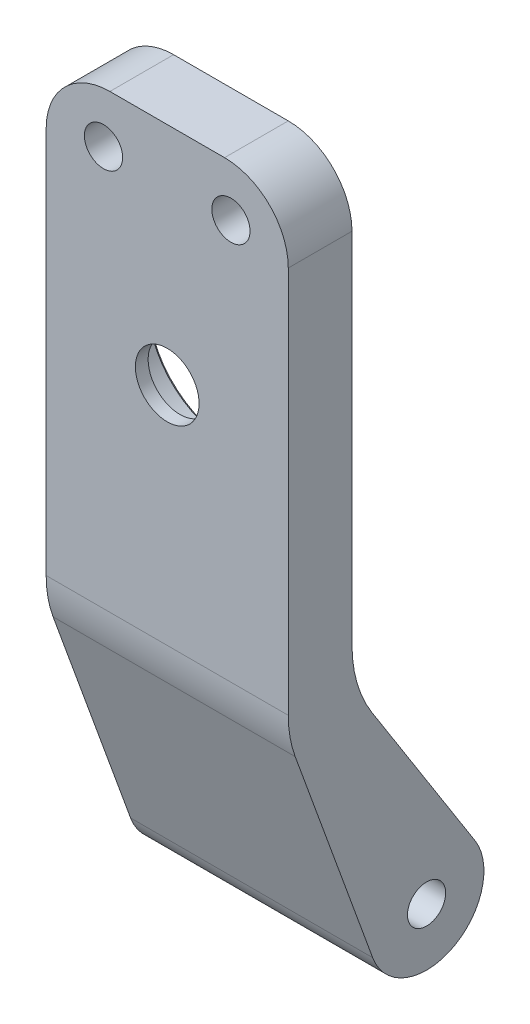
ISO-10303-21;
HEADER;
FILE_DESCRIPTION(('STEP AP214'),'2;1');
FILE_NAME('part.step','',(''),(''),'','','');
FILE_SCHEMA(('AUTOMOTIVE_DESIGN { 1 0 10303 214 1 1 1 1 }'));
ENDSEC;
DATA;
#1=APPLICATION_CONTEXT('core data for automotive mechanical design processes');
#2=APPLICATION_PROTOCOL_DEFINITION('international standard','automotive_design',2000,#1);
#3=PRODUCT_CONTEXT('',#1,'mechanical');
#4=PRODUCT('Part','Part','',(#3));
#5=PRODUCT_RELATED_PRODUCT_CATEGORY('part','',(#4));
#6=PRODUCT_DEFINITION_FORMATION('','',#4);
#7=PRODUCT_DEFINITION_CONTEXT('part definition',#1,'design');
#8=PRODUCT_DEFINITION('design','',#6,#7);
#9=PRODUCT_DEFINITION_SHAPE('','',#8);
#10=(LENGTH_UNIT() NAMED_UNIT(*) SI_UNIT(.MILLI.,.METRE.));
#11=(NAMED_UNIT(*) PLANE_ANGLE_UNIT() SI_UNIT($,.RADIAN.));
#12=(NAMED_UNIT(*) SI_UNIT($,.STERADIAN.) SOLID_ANGLE_UNIT());
#13=UNCERTAINTY_MEASURE_WITH_UNIT(LENGTH_MEASURE(1.E-05),#10,'distance_accuracy_value','');
#14=(GEOMETRIC_REPRESENTATION_CONTEXT(3) GLOBAL_UNCERTAINTY_ASSIGNED_CONTEXT((#13)) GLOBAL_UNIT_ASSIGNED_CONTEXT((#10,
#11,#12)) REPRESENTATION_CONTEXT('',''));
#15=CARTESIAN_POINT('',(0.,0.,0.));
#16=DIRECTION('',(0.,0.,1.));
#17=DIRECTION('',(1.,0.,0.));
#18=AXIS2_PLACEMENT_3D('',#15,#16,#17);
#19=CARTESIAN_POINT('',(0.,13.1015537091819,20.7143094769658));
#20=DIRECTION('',(0.,0.,-1.));
#21=DIRECTION('',(-1.,0.,0.));
#22=AXIS2_PLACEMENT_3D('',#19,#20,#21);
#23=CONICAL_SURFACE('',#22,6.,0.785398163397448);
#24=CARTESIAN_POINT('',(0.,13.1015537091819,20.2143094769658));
#25=DIRECTION('',(0.,0.,1.));
#26=DIRECTION('',(-1.,0.,0.));
#27=AXIS2_PLACEMENT_3D('',#24,#25,#26);
#28=CIRCLE('',#27,6.5);
#29=CARTESIAN_POINT('',(-6.5,13.1015537091819,20.2143094769658));
#30=VERTEX_POINT('',#29);
#31=EDGE_CURVE('E145',#30,#30,#28,.T.);
#32=ORIENTED_EDGE('',*,*,#31,.F.);
#33=EDGE_LOOP('',(#32));
#34=FACE_BOUND('',#33,.T.);
#35=CARTESIAN_POINT('',(0.,13.1015537091819,20.4643094769658));
#36=DIRECTION('',(0.,0.,-1.));
#37=DIRECTION('',(-1.,0.,0.));
#38=AXIS2_PLACEMENT_3D('',#35,#36,#37);
#39=CIRCLE('',#38,6.25);
#40=CARTESIAN_POINT('',(-6.25,13.1015537091819,20.4643094769658));
#41=VERTEX_POINT('',#40);
#42=EDGE_CURVE('E173',#41,#41,#39,.T.);
#43=ORIENTED_EDGE('',*,*,#42,.F.);
#44=EDGE_LOOP('',(#43));
#45=FACE_BOUND('',#44,.T.);
#46=ADVANCED_FACE('F43',(#34,#45),#23,.F.);
#47=CARTESIAN_POINT('',(9.5,7.60659887027264,25.2143094769657));
#48=DIRECTION('',(0.,0.,-1.));
#49=DIRECTION('',(-1.,0.,0.));
#50=AXIS2_PLACEMENT_3D('',#47,#48,#49);
#51=PLANE('',#50);
#52=CARTESIAN_POINT('',(-5.,26.8080822959938,25.2143094769657));
#53=DIRECTION('',(0.,0.,1.));
#54=DIRECTION('',(1.,0.,0.));
#55=AXIS2_PLACEMENT_3D('',#52,#53,#54);
#56=CIRCLE('',#55,1.5);
#57=CARTESIAN_POINT('',(-3.5,26.8080822959938,25.2143094769657));
#58=VERTEX_POINT('',#57);
#59=EDGE_CURVE('E179',#58,#58,#56,.T.);
#60=ORIENTED_EDGE('',*,*,#59,.F.);
#61=EDGE_LOOP('',(#60));
#62=FACE_BOUND('',#61,.T.);
#63=CARTESIAN_POINT('',(5.,26.8080822959938,25.2143094769657));
#64=DIRECTION('',(0.,0.,1.));
#65=DIRECTION('',(1.,0.,0.));
#66=AXIS2_PLACEMENT_3D('',#63,#64,#65);
#67=CIRCLE('',#66,1.5);
#68=CARTESIAN_POINT('',(6.5,26.8080822959938,25.2143094769657));
#69=VERTEX_POINT('',#68);
#70=EDGE_CURVE('E184',#69,#69,#67,.T.);
#71=ORIENTED_EDGE('',*,*,#70,.F.);
#72=EDGE_LOOP('',(#71));
#73=FACE_BOUND('',#72,.T.);
#74=CARTESIAN_POINT('',(0.,13.1015537091819,25.2143094769657));
#75=DIRECTION('',(0.,0.,-1.));
#76=DIRECTION('',(0.,1.,0.));
#77=AXIS2_PLACEMENT_3D('',#74,#75,#76);
#78=CIRCLE('',#77,2.5);
#79=CARTESIAN_POINT('',(0.,15.6015537091819,25.2143094769657));
#80=VERTEX_POINT('',#79);
#81=EDGE_CURVE('E11',#80,#80,#78,.T.);
#82=ORIENTED_EDGE('',*,*,#81,.T.);
#83=EDGE_LOOP('',(#82));
#84=FACE_BOUND('',#83,.T.);
#85=DIRECTION('',(-1.,0.,0.));
#86=VECTOR('',#85,1.);
#87=CARTESIAN_POINT('',(9.5,30.8080822959938,25.2143094769657));
#88=LINE('',#87,#86);
#89=CARTESIAN_POINT('',(4.5,30.8080822959938,25.2143094769657));
#90=VERTEX_POINT('',#89);
#91=CARTESIAN_POINT('',(-4.5,30.8080822959938,25.2143094769657));
#92=VERTEX_POINT('',#91);
#93=EDGE_CURVE('E53',#90,#92,#88,.T.);
#94=ORIENTED_EDGE('',*,*,#93,.T.);
#95=CARTESIAN_POINT('',(-4.5,25.8080822959938,25.2143094769657));
#96=DIRECTION('',(0.,0.,1.));
#97=DIRECTION('',(0.,1.,0.));
#98=AXIS2_PLACEMENT_3D('',#95,#96,#97);
#99=CIRCLE('',#98,5.);
#100=CARTESIAN_POINT('',(-9.5,25.8080822959938,25.2143094769657));
#101=VERTEX_POINT('',#100);
#102=EDGE_CURVE('E219',#92,#101,#99,.T.);
#103=ORIENTED_EDGE('',*,*,#102,.T.);
#104=DIRECTION('',(0.,-1.,0.));
#105=VECTOR('',#104,1.);
#106=CARTESIAN_POINT('',(-9.5,7.60659887027264,25.2143094769657));
#107=LINE('',#106,#105);
#108=CARTESIAN_POINT('',(-9.5,-4.59488455544854,25.2143094769657));
#109=VERTEX_POINT('',#108);
#110=EDGE_CURVE('E214',#101,#109,#107,.T.);
#111=ORIENTED_EDGE('',*,*,#110,.T.);
#112=DIRECTION('',(-1.,0.,0.));
#113=VECTOR('',#112,1.);
#114=CARTESIAN_POINT('',(9.5,-4.59488455544854,25.2143094769657));
#115=LINE('',#114,#113);
#116=CARTESIAN_POINT('',(9.5,-4.59488455544854,25.2143094769657));
#117=VERTEX_POINT('',#116);
#118=EDGE_CURVE('E201',#117,#109,#115,.T.);
#119=ORIENTED_EDGE('',*,*,#118,.F.);
#120=DIRECTION('',(0.,-1.,0.));
#121=VECTOR('',#120,1.);
#122=CARTESIAN_POINT('',(9.5,7.60659887027264,25.2143094769657));
#123=LINE('',#122,#121);
#124=CARTESIAN_POINT('',(9.5,25.8080822959938,25.2143094769657));
#125=VERTEX_POINT('',#124);
#126=EDGE_CURVE('E207',#125,#117,#123,.T.);
#127=ORIENTED_EDGE('',*,*,#126,.F.);
#128=CARTESIAN_POINT('',(4.5,25.8080822959938,25.2143094769657));
#129=DIRECTION('',(0.,0.,1.));
#130=DIRECTION('',(0.,1.,0.));
#131=AXIS2_PLACEMENT_3D('',#128,#129,#130);
#132=CIRCLE('',#131,5.);
#133=EDGE_CURVE('E206',#125,#90,#132,.T.);
#134=ORIENTED_EDGE('',*,*,#133,.T.);
#135=EDGE_LOOP('',(#94,#103,#111,#119,#127,#134));
#136=FACE_BOUND('',#135,.T.);
#137=ADVANCED_FACE('F45',(#62,#73,#84,#136),#51,.F.);
#138=CARTESIAN_POINT('',(9.5,-4.59488455544854,16.2143094769658));
#139=DIRECTION('',(-1.,0.,0.));
#140=DIRECTION('',(0.,0.,1.));
#141=AXIS2_PLACEMENT_3D('',#138,#139,#140);
#142=CYLINDRICAL_SURFACE('',#141,9.);
#143=CARTESIAN_POINT('',(-9.5,-4.59488455544854,16.2143094769658));
#144=DIRECTION('',(1.,0.,0.));
#145=DIRECTION('',(0.,0.,-1.));
#146=AXIS2_PLACEMENT_3D('',#143,#144,#145);
#147=CIRCLE('',#146,9.);
#148=CARTESIAN_POINT('',(-9.5,-7.67306584537955,24.671543064039));
#149=VERTEX_POINT('',#148);
#150=EDGE_CURVE('E203',#109,#149,#147,.T.);
#151=ORIENTED_EDGE('',*,*,#150,.T.);
#152=DIRECTION('',(-1.,0.,0.));
#153=VECTOR('',#152,1.);
#154=CARTESIAN_POINT('',(9.5,-7.67306584537955,24.671543064039));
#155=LINE('',#154,#153);
#156=CARTESIAN_POINT('',(9.5,-7.67306584537955,24.671543064039));
#157=VERTEX_POINT('',#156);
#158=EDGE_CURVE('E202',#157,#149,#155,.T.);
#159=ORIENTED_EDGE('',*,*,#158,.F.);
#160=CARTESIAN_POINT('',(9.5,-4.59488455544854,16.2143094769658));
#161=DIRECTION('',(1.,0.,0.));
#162=DIRECTION('',(0.,0.,-1.));
#163=AXIS2_PLACEMENT_3D('',#160,#161,#162);
#164=CIRCLE('',#163,9.);
#165=EDGE_CURVE('E210',#117,#157,#164,.T.);
#166=ORIENTED_EDGE('',*,*,#165,.F.);
#167=ORIENTED_EDGE('',*,*,#118,.T.);
#168=EDGE_LOOP('',(#151,#159,#166,#167));
#169=FACE_BOUND('',#168,.T.);
#170=ADVANCED_FACE('F264',(#169),#142,.T.);
#171=CARTESIAN_POINT('',(9.5,-16.0287039880252,21.6303394918166));
#172=DIRECTION('',(0.,-0.342020143325669,0.939692620785908));
#173=DIRECTION('',(-1.,0.,0.));
#174=AXIS2_PLACEMENT_3D('',#171,#172,#173);
#175=PLANE('',#174);
#176=DIRECTION('',(0.,0.939692620785908,0.342020143325669));
#177=VECTOR('',#176,1.);
#178=CARTESIAN_POINT('',(-9.5,-16.0287039880252,21.6303394918166));
#179=LINE('',#178,#177);
#180=CARTESIAN_POINT('',(-9.5,-24.3843421306709,18.5891359195942));
#181=VERTEX_POINT('',#180);
#182=EDGE_CURVE('E141',#181,#149,#179,.T.);
#183=ORIENTED_EDGE('',*,*,#182,.F.);
#184=DIRECTION('',(-1.,0.,0.));
#185=VECTOR('',#184,1.);
#186=CARTESIAN_POINT('',(9.5,-24.3843421306709,18.5891359195942));
#187=LINE('',#186,#185);
#188=CARTESIAN_POINT('',(9.5,-24.3843421306709,18.5891359195942));
#189=VERTEX_POINT('',#188);
#190=EDGE_CURVE('E172',#189,#181,#187,.T.);
#191=ORIENTED_EDGE('',*,*,#190,.F.);
#192=DIRECTION('',(0.,0.939692620785908,0.342020143325669));
#193=VECTOR('',#192,1.);
#194=CARTESIAN_POINT('',(9.5,-16.0287039880252,21.6303394918166));
#195=LINE('',#194,#193);
#196=EDGE_CURVE('E198',#189,#157,#195,.T.);
#197=ORIENTED_EDGE('',*,*,#196,.T.);
#198=ORIENTED_EDGE('',*,*,#158,.T.);
#199=EDGE_LOOP('',(#183,#191,#197,#198));
#200=FACE_BOUND('',#199,.T.);
#201=ADVANCED_FACE('F267',(#200),#175,.T.);
#202=CARTESIAN_POINT('',(9.5,-22.8452514857054,14.3605191260576));
#203=DIRECTION('',(-1.,0.,0.));
#204=DIRECTION('',(0.,0.,1.));
#205=AXIS2_PLACEMENT_3D('',#202,#203,#204);
#206=CYLINDRICAL_SURFACE('',#205,4.5);
#207=CARTESIAN_POINT('',(-9.5,-22.8452514857054,14.3605191260576));
#208=DIRECTION('',(1.,0.,0.));
#209=DIRECTION('',(0.,0.,-1.));
#210=AXIS2_PLACEMENT_3D('',#207,#208,#209);
#211=CIRCLE('',#210,4.5);
#212=CARTESIAN_POINT('',(-9.5,-20.4343265102656,10.5608558827161));
#213=VERTEX_POINT('',#212);
#214=EDGE_CURVE('E224',#181,#213,#211,.T.);
#215=ORIENTED_EDGE('',*,*,#214,.T.);
#216=DIRECTION('',(-1.,0.,0.));
#217=VECTOR('',#216,1.);
#218=CARTESIAN_POINT('',(9.5,-20.4343265102656,10.5608558827161));
#219=LINE('',#218,#217);
#220=CARTESIAN_POINT('',(9.5,-20.4343265102656,10.5608558827161));
#221=VERTEX_POINT('',#220);
#222=EDGE_CURVE('E137',#221,#213,#219,.T.);
#223=ORIENTED_EDGE('',*,*,#222,.F.);
#224=CARTESIAN_POINT('',(9.5,-22.8452514857054,14.3605191260576));
#225=DIRECTION('',(1.,0.,0.));
#226=DIRECTION('',(0.,0.,-1.));
#227=AXIS2_PLACEMENT_3D('',#224,#225,#226);
#228=CIRCLE('',#227,4.5);
#229=EDGE_CURVE('E128',#189,#221,#228,.T.);
#230=ORIENTED_EDGE('',*,*,#229,.F.);
#231=ORIENTED_EDGE('',*,*,#190,.T.);
#232=EDGE_LOOP('',(#215,#223,#230,#231));
#233=FACE_BOUND('',#232,.T.);
#234=ADVANCED_FACE('F269',(#233),#206,.T.);
#235=CARTESIAN_POINT('',(9.5,-14.0536961778226,14.6094307279982));
#236=DIRECTION('',(0.,0.535761105653282,-0.844369609631453));
#237=DIRECTION('',(-1.,0.,0.));
#238=AXIS2_PLACEMENT_3D('',#235,#236,#237);
#239=PLANE('',#238);
#240=DIRECTION('',(0.,-0.844369609631453,-0.535761105653282));
#241=VECTOR('',#240,1.);
#242=CARTESIAN_POINT('',(-9.5,-14.0536961778226,14.6094307279982));
#243=LINE('',#242,#241);
#244=CARTESIAN_POINT('',(-9.5,-7.67306584537955,18.6580055732803));
#245=VERTEX_POINT('',#244);
#246=EDGE_CURVE('E133',#245,#213,#243,.T.);
#247=ORIENTED_EDGE('',*,*,#246,.F.);
#248=DIRECTION('',(-1.,0.,0.));
#249=VECTOR('',#248,1.);
#250=CARTESIAN_POINT('',(9.5,-7.67306584537955,18.6580055732803));
#251=LINE('',#250,#249);
#252=CARTESIAN_POINT('',(9.5,-7.67306584537955,18.6580055732803));
#253=VERTEX_POINT('',#252);
#254=EDGE_CURVE('E136',#253,#245,#251,.T.);
#255=ORIENTED_EDGE('',*,*,#254,.F.);
#256=DIRECTION('',(0.,-0.844369609631453,-0.535761105653282));
#257=VECTOR('',#256,1.);
#258=CARTESIAN_POINT('',(9.5,-14.0536961778226,14.6094307279982));
#259=LINE('',#258,#257);
#260=EDGE_CURVE('E170',#253,#221,#259,.T.);
#261=ORIENTED_EDGE('',*,*,#260,.T.);
#262=ORIENTED_EDGE('',*,*,#222,.T.);
#263=EDGE_LOOP('',(#247,#255,#261,#262));
#264=FACE_BOUND('',#263,.T.);
#265=ADVANCED_FACE('F134',(#264),#239,.T.);
#266=CARTESIAN_POINT('',(9.5,-2.31545478884673,10.2143094769657));
#267=DIRECTION('',(-1.,0.,0.));
#268=DIRECTION('',(0.,0.,1.));
#269=AXIS2_PLACEMENT_3D('',#266,#267,#268);
#270=CYLINDRICAL_SURFACE('',#269,10.);
#271=CARTESIAN_POINT('',(-9.5,-2.31545478884673,10.2143094769657));
#272=DIRECTION('',(1.,0.,0.));
#273=DIRECTION('',(0.,0.,-1.));
#274=AXIS2_PLACEMENT_3D('',#271,#272,#273);
#275=CIRCLE('',#274,10.);
#276=CARTESIAN_POINT('',(-9.5,-2.31545478884673,20.2143094769658));
#277=VERTEX_POINT('',#276);
#278=EDGE_CURVE('E98',#277,#245,#275,.T.);
#279=ORIENTED_EDGE('',*,*,#278,.F.);
#280=DIRECTION('',(-1.,0.,0.));
#281=VECTOR('',#280,1.);
#282=CARTESIAN_POINT('',(9.5,-2.31545478884673,20.2143094769658));
#283=LINE('',#282,#281);
#284=CARTESIAN_POINT('',(9.5,-2.31545478884673,20.2143094769658));
#285=VERTEX_POINT('',#284);
#286=EDGE_CURVE('E92',#285,#277,#283,.T.);
#287=ORIENTED_EDGE('',*,*,#286,.F.);
#288=CARTESIAN_POINT('',(9.5,-2.31545478884673,10.2143094769657));
#289=DIRECTION('',(1.,0.,0.));
#290=DIRECTION('',(0.,0.,-1.));
#291=AXIS2_PLACEMENT_3D('',#288,#289,#290);
#292=CIRCLE('',#291,10.);
#293=EDGE_CURVE('E144',#285,#253,#292,.T.);
#294=ORIENTED_EDGE('',*,*,#293,.T.);
#295=ORIENTED_EDGE('',*,*,#254,.T.);
#296=EDGE_LOOP('',(#279,#287,#294,#295));
#297=FACE_BOUND('',#296,.T.);
#298=ADVANCED_FACE('F143',(#297),#270,.F.);
#299=CARTESIAN_POINT('',(9.5,7.91732382523638,20.2143094769658));
#300=DIRECTION('',(0.,0.,-1.));
#301=DIRECTION('',(0.,-1.,0.));
#302=AXIS2_PLACEMENT_3D('',#299,#300,#301);
#303=PLANE('',#302);
#304=CARTESIAN_POINT('',(-5.,26.8080822959938,20.2143094769658));
#305=DIRECTION('',(0.,0.,-1.));
#306=DIRECTION('',(-1.,0.,0.));
#307=AXIS2_PLACEMENT_3D('',#304,#305,#306);
#308=CIRCLE('',#307,1.5);
#309=CARTESIAN_POINT('',(-6.5,26.8080822959938,20.2143094769658));
#310=VERTEX_POINT('',#309);
#311=EDGE_CURVE('E47',#310,#310,#308,.T.);
#312=ORIENTED_EDGE('',*,*,#311,.F.);
#313=EDGE_LOOP('',(#312));
#314=FACE_BOUND('',#313,.T.);
#315=CARTESIAN_POINT('',(5.,26.8080822959938,20.2143094769658));
#316=DIRECTION('',(0.,0.,-1.));
#317=DIRECTION('',(-1.,0.,0.));
#318=AXIS2_PLACEMENT_3D('',#315,#316,#317);
#319=CIRCLE('',#318,1.5);
#320=CARTESIAN_POINT('',(3.5,26.8080822959938,20.2143094769658));
#321=VERTEX_POINT('',#320);
#322=EDGE_CURVE('E177',#321,#321,#319,.T.);
#323=ORIENTED_EDGE('',*,*,#322,.F.);
#324=EDGE_LOOP('',(#323));
#325=FACE_BOUND('',#324,.T.);
#326=ORIENTED_EDGE('',*,*,#31,.T.);
#327=EDGE_LOOP('',(#326));
#328=FACE_BOUND('',#327,.T.);
#329=DIRECTION('',(0.,-1.,0.));
#330=VECTOR('',#329,1.);
#331=CARTESIAN_POINT('',(-9.5,7.91732382523638,20.2143094769658));
#332=LINE('',#331,#330);
#333=CARTESIAN_POINT('',(-9.5,25.8080822959938,20.2143094769658));
#334=VERTEX_POINT('',#333);
#335=EDGE_CURVE('E152',#334,#277,#332,.T.);
#336=ORIENTED_EDGE('',*,*,#335,.F.);
#337=CARTESIAN_POINT('',(-4.5,25.8080822959938,20.2143094769658));
#338=DIRECTION('',(0.,0.,-1.));
#339=DIRECTION('',(-1.,0.,0.));
#340=AXIS2_PLACEMENT_3D('',#337,#338,#339);
#341=CIRCLE('',#340,5.);
#342=CARTESIAN_POINT('',(-4.5,30.8080822959938,20.2143094769658));
#343=VERTEX_POINT('',#342);
#344=EDGE_CURVE('E162',#334,#343,#341,.T.);
#345=ORIENTED_EDGE('',*,*,#344,.T.);
#346=DIRECTION('',(-1.,0.,0.));
#347=VECTOR('',#346,1.);
#348=CARTESIAN_POINT('',(9.5,30.8080822959938,20.2143094769658));
#349=LINE('',#348,#347);
#350=CARTESIAN_POINT('',(4.5,30.8080822959938,20.2143094769658));
#351=VERTEX_POINT('',#350);
#352=EDGE_CURVE('E164',#351,#343,#349,.T.);
#353=ORIENTED_EDGE('',*,*,#352,.F.);
#354=CARTESIAN_POINT('',(4.5,25.8080822959938,20.2143094769658));
#355=DIRECTION('',(0.,0.,-1.));
#356=DIRECTION('',(-1.,0.,0.));
#357=AXIS2_PLACEMENT_3D('',#354,#355,#356);
#358=CIRCLE('',#357,5.);
#359=CARTESIAN_POINT('',(9.5,25.8080822959938,20.2143094769658));
#360=VERTEX_POINT('',#359);
#361=EDGE_CURVE('E159',#351,#360,#358,.T.);
#362=ORIENTED_EDGE('',*,*,#361,.T.);
#363=DIRECTION('',(0.,-1.,0.));
#364=VECTOR('',#363,1.);
#365=CARTESIAN_POINT('',(9.5,7.91732382523638,20.2143094769658));
#366=LINE('',#365,#364);
#367=EDGE_CURVE('E163',#360,#285,#366,.T.);
#368=ORIENTED_EDGE('',*,*,#367,.T.);
#369=ORIENTED_EDGE('',*,*,#286,.T.);
#370=EDGE_LOOP('',(#336,#345,#353,#362,#368,#369));
#371=FACE_BOUND('',#370,.T.);
#372=ADVANCED_FACE('F251',(#314,#325,#328,#371),#303,.T.);
#373=CARTESIAN_POINT('',(9.5,30.8080822959938,22.7143094769658));
#374=DIRECTION('',(0.,1.,0.));
#375=DIRECTION('',(1.,0.,0.));
#376=AXIS2_PLACEMENT_3D('',#373,#374,#375);
#377=PLANE('',#376);
#378=ORIENTED_EDGE('',*,*,#352,.T.);
#379=DIRECTION('',(0.,0.,1.));
#380=VECTOR('',#379,1.);
#381=CARTESIAN_POINT('',(-4.5,30.8080822959938,25.2143094769657));
#382=LINE('',#381,#380);
#383=EDGE_CURVE('E166',#343,#92,#382,.T.);
#384=ORIENTED_EDGE('',*,*,#383,.T.);
#385=ORIENTED_EDGE('',*,*,#93,.F.);
#386=DIRECTION('',(0.,0.,-1.));
#387=VECTOR('',#386,1.);
#388=CARTESIAN_POINT('',(4.5,30.8080822959938,22.7143094769658));
#389=LINE('',#388,#387);
#390=EDGE_CURVE('E169',#90,#351,#389,.T.);
#391=ORIENTED_EDGE('',*,*,#390,.T.);
#392=EDGE_LOOP('',(#378,#384,#385,#391));
#393=FACE_BOUND('',#392,.T.);
#394=ADVANCED_FACE('F244',(#393),#377,.T.);
#395=CARTESIAN_POINT('',(9.5,1.73141540514422,17.5374143015117));
#396=DIRECTION('',(1.,0.,0.));
#397=DIRECTION('',(0.,1.,0.));
#398=AXIS2_PLACEMENT_3D('',#395,#396,#397);
#399=PLANE('',#398);
#400=ORIENTED_EDGE('',*,*,#367,.F.);
#401=DIRECTION('',(0.,0.,1.));
#402=VECTOR('',#401,1.);
#403=CARTESIAN_POINT('',(9.5,25.8080822959938,17.5374143015117));
#404=LINE('',#403,#402);
#405=EDGE_CURVE('E209',#360,#125,#404,.T.);
#406=ORIENTED_EDGE('',*,*,#405,.T.);
#407=ORIENTED_EDGE('',*,*,#126,.T.);
#408=ORIENTED_EDGE('',*,*,#165,.T.);
#409=ORIENTED_EDGE('',*,*,#196,.F.);
#410=ORIENTED_EDGE('',*,*,#229,.T.);
#411=ORIENTED_EDGE('',*,*,#260,.F.);
#412=ORIENTED_EDGE('',*,*,#293,.F.);
#413=EDGE_LOOP('',(#400,#406,#407,#408,#409,#410,#411,#412));
#414=FACE_BOUND('',#413,.T.);
#415=CARTESIAN_POINT('',(9.5,-22.8452514857054,14.3605191260576));
#416=DIRECTION('',(1.,0.,0.));
#417=DIRECTION('',(0.,0.,-1.));
#418=AXIS2_PLACEMENT_3D('',#415,#416,#417);
#419=CIRCLE('',#418,1.5);
#420=CARTESIAN_POINT('',(9.5,-22.8452514857054,12.8605191260576));
#421=VERTEX_POINT('',#420);
#422=EDGE_CURVE('E189',#421,#421,#419,.F.);
#423=ORIENTED_EDGE('',*,*,#422,.T.);
#424=EDGE_LOOP('',(#423));
#425=FACE_BOUND('',#424,.T.);
#426=ADVANCED_FACE('F260',(#414,#425),#399,.T.);
#427=CARTESIAN_POINT('',(-9.5,1.73141540514422,17.5374143015117));
#428=DIRECTION('',(1.,0.,0.));
#429=DIRECTION('',(0.,1.,0.));
#430=AXIS2_PLACEMENT_3D('',#427,#428,#429);
#431=PLANE('',#430);
#432=ORIENTED_EDGE('',*,*,#110,.F.);
#433=DIRECTION('',(0.,0.,-1.));
#434=VECTOR('',#433,1.);
#435=CARTESIAN_POINT('',(-9.5,25.8080822959938,20.2143094769658));
#436=LINE('',#435,#434);
#437=EDGE_CURVE('E154',#101,#334,#436,.T.);
#438=ORIENTED_EDGE('',*,*,#437,.T.);
#439=ORIENTED_EDGE('',*,*,#335,.T.);
#440=ORIENTED_EDGE('',*,*,#278,.T.);
#441=ORIENTED_EDGE('',*,*,#246,.T.);
#442=ORIENTED_EDGE('',*,*,#214,.F.);
#443=ORIENTED_EDGE('',*,*,#182,.T.);
#444=ORIENTED_EDGE('',*,*,#150,.F.);
#445=EDGE_LOOP('',(#432,#438,#439,#440,#441,#442,#443,#444));
#446=FACE_BOUND('',#445,.T.);
#447=CARTESIAN_POINT('',(-9.5,-22.8452514857054,14.3605191260576));
#448=DIRECTION('',(-1.,0.,0.));
#449=DIRECTION('',(0.,0.,1.));
#450=AXIS2_PLACEMENT_3D('',#447,#448,#449);
#451=CIRCLE('',#450,1.5);
#452=CARTESIAN_POINT('',(-9.5,-22.8452514857054,15.8605191260576));
#453=VERTEX_POINT('',#452);
#454=EDGE_CURVE('E333',#453,#453,#451,.T.);
#455=ORIENTED_EDGE('',*,*,#454,.F.);
#456=EDGE_LOOP('',(#455));
#457=FACE_BOUND('',#456,.T.);
#458=ADVANCED_FACE('F149',(#446,#457),#431,.F.);
#459=CARTESIAN_POINT('',(-4.5,25.8080822959938,17.5374143015117));
#460=DIRECTION('',(0.,0.,1.));
#461=DIRECTION('',(1.,0.,0.));
#462=AXIS2_PLACEMENT_3D('',#459,#460,#461);
#463=CYLINDRICAL_SURFACE('',#462,5.);
#464=ORIENTED_EDGE('',*,*,#102,.F.);
#465=ORIENTED_EDGE('',*,*,#383,.F.);
#466=ORIENTED_EDGE('',*,*,#344,.F.);
#467=ORIENTED_EDGE('',*,*,#437,.F.);
#468=EDGE_LOOP('',(#464,#465,#466,#467));
#469=FACE_BOUND('',#468,.T.);
#470=ADVANCED_FACE('F256',(#469),#463,.T.);
#471=CARTESIAN_POINT('',(4.5,25.8080822959938,22.7143094769658));
#472=DIRECTION('',(0.,0.,-1.));
#473=DIRECTION('',(-1.,0.,0.));
#474=AXIS2_PLACEMENT_3D('',#471,#472,#473);
#475=CYLINDRICAL_SURFACE('',#474,5.);
#476=ORIENTED_EDGE('',*,*,#133,.F.);
#477=ORIENTED_EDGE('',*,*,#405,.F.);
#478=ORIENTED_EDGE('',*,*,#361,.F.);
#479=ORIENTED_EDGE('',*,*,#390,.F.);
#480=EDGE_LOOP('',(#476,#477,#478,#479));
#481=FACE_BOUND('',#480,.T.);
#482=ADVANCED_FACE('F248',(#481),#475,.T.);
#483=CARTESIAN_POINT('',(0.,13.1015537091819,16.5143094769657));
#484=DIRECTION('',(0.,0.,1.));
#485=DIRECTION('',(1.,0.,0.));
#486=AXIS2_PLACEMENT_3D('',#483,#484,#485);
#487=CYLINDRICAL_SURFACE('',#486,2.5);
#488=ORIENTED_EDGE('',*,*,#81,.F.);
#489=EDGE_LOOP('',(#488));
#490=FACE_BOUND('',#489,.T.);
#491=CARTESIAN_POINT('',(0.,13.1015537091819,24.2143094769658));
#492=DIRECTION('',(0.,0.,-1.));
#493=DIRECTION('',(-1.,0.,0.));
#494=AXIS2_PLACEMENT_3D('',#491,#492,#493);
#495=CIRCLE('',#494,2.5);
#496=CARTESIAN_POINT('',(-2.5,13.1015537091819,24.2143094769658));
#497=VERTEX_POINT('',#496);
#498=EDGE_CURVE('E175',#497,#497,#495,.T.);
#499=ORIENTED_EDGE('',*,*,#498,.T.);
#500=EDGE_LOOP('',(#499));
#501=FACE_BOUND('',#500,.T.);
#502=ADVANCED_FACE('F290',(#490,#501),#487,.F.);
#503=CARTESIAN_POINT('',(0.,13.1015537091819,24.2143094769658));
#504=DIRECTION('',(0.,0.,-1.));
#505=DIRECTION('',(-1.,0.,0.));
#506=AXIS2_PLACEMENT_3D('',#503,#504,#505);
#507=PLANE('',#506);
#508=ORIENTED_EDGE('',*,*,#498,.F.);
#509=EDGE_LOOP('',(#508));
#510=FACE_BOUND('',#509,.T.);
#511=CARTESIAN_POINT('',(0.,13.1015537091819,24.2143094769658));
#512=DIRECTION('',(0.,0.,-1.));
#513=DIRECTION('',(-1.,0.,0.));
#514=AXIS2_PLACEMENT_3D('',#511,#512,#513);
#515=CIRCLE('',#514,6.25);
#516=CARTESIAN_POINT('',(-6.25,13.1015537091819,24.2143094769658));
#517=VERTEX_POINT('',#516);
#518=EDGE_CURVE('E176',#517,#517,#515,.T.);
#519=ORIENTED_EDGE('',*,*,#518,.T.);
#520=EDGE_LOOP('',(#519));
#521=FACE_BOUND('',#520,.T.);
#522=ADVANCED_FACE('F301',(#510,#521),#507,.T.);
#523=CARTESIAN_POINT('',(0.,13.1015537091819,9.8605191260576));
#524=DIRECTION('',(0.,0.,1.));
#525=DIRECTION('',(1.,0.,0.));
#526=AXIS2_PLACEMENT_3D('',#523,#524,#525);
#527=CYLINDRICAL_SURFACE('',#526,6.25);
#528=ORIENTED_EDGE('',*,*,#518,.F.);
#529=EDGE_LOOP('',(#528));
#530=FACE_BOUND('',#529,.T.);
#531=ORIENTED_EDGE('',*,*,#42,.T.);
#532=EDGE_LOOP('',(#531));
#533=FACE_BOUND('',#532,.T.);
#534=ADVANCED_FACE('F313',(#530,#533),#527,.F.);
#535=CARTESIAN_POINT('',(5.,26.8080822959938,15.2143094769657));
#536=DIRECTION('',(0.,0.,1.));
#537=DIRECTION('',(1.,0.,0.));
#538=AXIS2_PLACEMENT_3D('',#535,#536,#537);
#539=CYLINDRICAL_SURFACE('',#538,1.5);
#540=ORIENTED_EDGE('',*,*,#322,.T.);
#541=EDGE_LOOP('',(#540));
#542=FACE_BOUND('',#541,.T.);
#543=ORIENTED_EDGE('',*,*,#70,.T.);
#544=EDGE_LOOP('',(#543));
#545=FACE_BOUND('',#544,.T.);
#546=ADVANCED_FACE('F317',(#542,#545),#539,.F.);
#547=CARTESIAN_POINT('',(-5.,26.8080822959938,15.2143094769657));
#548=DIRECTION('',(0.,0.,1.));
#549=DIRECTION('',(1.,0.,0.));
#550=AXIS2_PLACEMENT_3D('',#547,#548,#549);
#551=CYLINDRICAL_SURFACE('',#550,1.5);
#552=ORIENTED_EDGE('',*,*,#311,.T.);
#553=EDGE_LOOP('',(#552));
#554=FACE_BOUND('',#553,.T.);
#555=ORIENTED_EDGE('',*,*,#59,.T.);
#556=EDGE_LOOP('',(#555));
#557=FACE_BOUND('',#556,.T.);
#558=ADVANCED_FACE('F321',(#554,#557),#551,.F.);
#559=CARTESIAN_POINT('',(17.278174593052,-22.8452514857054,14.3605191260576));
#560=DIRECTION('',(-1.,0.,0.));
#561=DIRECTION('',(0.,0.,1.));
#562=AXIS2_PLACEMENT_3D('',#559,#560,#561);
#563=CYLINDRICAL_SURFACE('',#562,1.5);
#564=ORIENTED_EDGE('',*,*,#454,.T.);
#565=EDGE_LOOP('',(#564));
#566=FACE_BOUND('',#565,.T.);
#567=ORIENTED_EDGE('',*,*,#422,.F.);
#568=EDGE_LOOP('',(#567));
#569=FACE_BOUND('',#568,.T.);
#570=ADVANCED_FACE('F324',(#566,#569),#563,.F.);
#571=CLOSED_SHELL('',(#46,#137,#170,#201,#234,#265,#298,#372,#394,#426,#458,#470,#482,#502,#522,
#534,#546,#558,#570));
#572=MANIFOLD_SOLID_BREP('B2',#571);
#573=ADVANCED_BREP_SHAPE_REPRESENTATION('',(#18,#572),#14);
#574=SHAPE_DEFINITION_REPRESENTATION(#9,#573);
ENDSEC;
END-ISO-10303-21;
